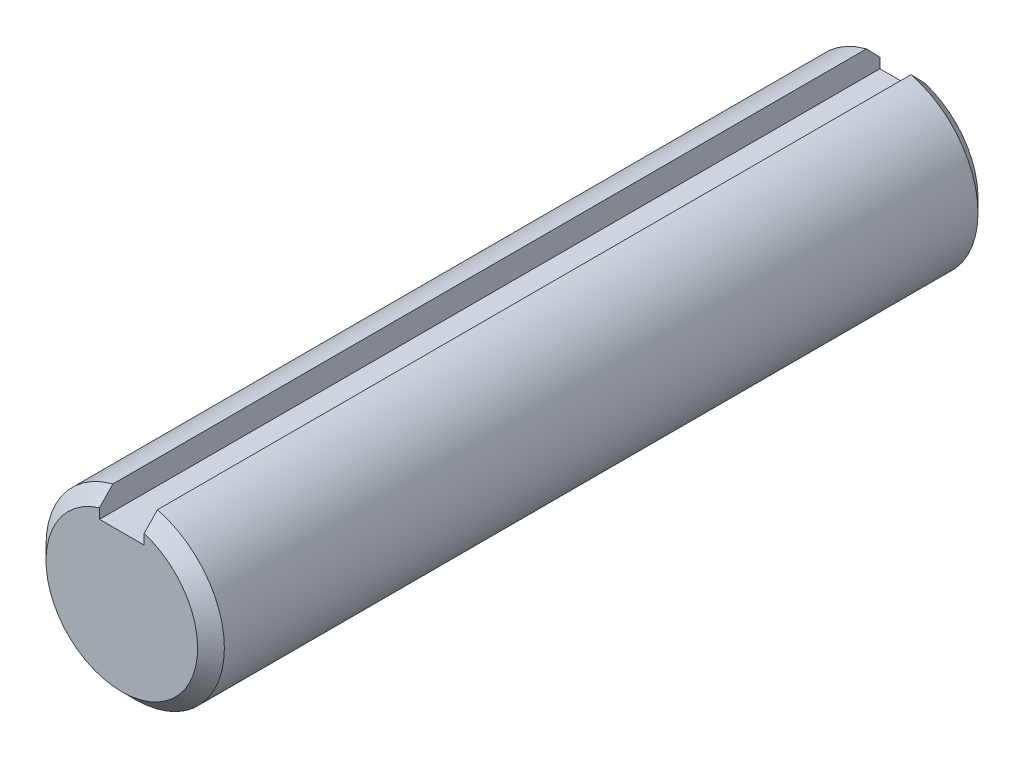
ISO-10303-21;
HEADER;
FILE_DESCRIPTION(('STEP AP214'),'2;1');
FILE_NAME('part.step','',(''),(''),'','','');
FILE_SCHEMA(('AUTOMOTIVE_DESIGN { 1 0 10303 214 1 1 1 1 }'));
ENDSEC;
DATA;
#1=APPLICATION_CONTEXT('core data for automotive mechanical design processes');
#2=APPLICATION_PROTOCOL_DEFINITION('international standard','automotive_design',2000,#1);
#3=PRODUCT_CONTEXT('',#1,'mechanical');
#4=PRODUCT('Part','Part','',(#3));
#5=PRODUCT_RELATED_PRODUCT_CATEGORY('part','',(#4));
#6=PRODUCT_DEFINITION_FORMATION('','',#4);
#7=PRODUCT_DEFINITION_CONTEXT('part definition',#1,'design');
#8=PRODUCT_DEFINITION('design','',#6,#7);
#9=PRODUCT_DEFINITION_SHAPE('','',#8);
#10=(LENGTH_UNIT() NAMED_UNIT(*) SI_UNIT(.MILLI.,.METRE.));
#11=(NAMED_UNIT(*) PLANE_ANGLE_UNIT() SI_UNIT($,.RADIAN.));
#12=(NAMED_UNIT(*) SI_UNIT($,.STERADIAN.) SOLID_ANGLE_UNIT());
#13=UNCERTAINTY_MEASURE_WITH_UNIT(LENGTH_MEASURE(1.E-05),#10,'distance_accuracy_value','');
#14=(GEOMETRIC_REPRESENTATION_CONTEXT(3) GLOBAL_UNCERTAINTY_ASSIGNED_CONTEXT((#13)) GLOBAL_UNIT_ASSIGNED_CONTEXT((#10,
#11,#12)) REPRESENTATION_CONTEXT('',''));
#15=CARTESIAN_POINT('',(0.,0.,0.));
#16=DIRECTION('',(0.,0.,1.));
#17=DIRECTION('',(1.,0.,0.));
#18=AXIS2_PLACEMENT_3D('',#15,#16,#17);
#19=CARTESIAN_POINT('',(0.,0.,17.5));
#20=DIRECTION('',(0.,0.,-1.));
#21=DIRECTION('',(-1.,0.,0.));
#22=AXIS2_PLACEMENT_3D('',#19,#20,#21);
#23=CYLINDRICAL_SURFACE('',#22,4.);
#24=CARTESIAN_POINT('',(0.,0.,16.9));
#25=DIRECTION('',(0.,0.,1.));
#26=DIRECTION('',(1.,0.,0.));
#27=AXIS2_PLACEMENT_3D('',#24,#25,#26);
#28=CIRCLE('',#27,4.);
#29=CARTESIAN_POINT('',(1.,3.87298334620742,16.9));
#30=VERTEX_POINT('',#29);
#31=CARTESIAN_POINT('',(-1.,3.87298334620742,16.9));
#32=VERTEX_POINT('',#31);
#33=EDGE_CURVE('E154',#30,#32,#28,.F.);
#34=ORIENTED_EDGE('',*,*,#33,.T.);
#35=DIRECTION('',(0.,0.,-1.));
#36=VECTOR('',#35,1.);
#37=CARTESIAN_POINT('',(-1.,3.87298334620742,17.5));
#38=LINE('',#37,#36);
#39=CARTESIAN_POINT('',(-1.,3.87298334620742,-16.9));
#40=VERTEX_POINT('',#39);
#41=EDGE_CURVE('E131',#32,#40,#38,.T.);
#42=ORIENTED_EDGE('',*,*,#41,.T.);
#43=CARTESIAN_POINT('',(0.,0.,-16.9));
#44=DIRECTION('',(0.,0.,1.));
#45=DIRECTION('',(1.,0.,0.));
#46=AXIS2_PLACEMENT_3D('',#43,#44,#45);
#47=CIRCLE('',#46,4.);
#48=CARTESIAN_POINT('',(1.,3.87298334620742,-16.9));
#49=VERTEX_POINT('',#48);
#50=EDGE_CURVE('E151',#40,#49,#47,.T.);
#51=ORIENTED_EDGE('',*,*,#50,.T.);
#52=DIRECTION('',(0.,0.,-1.));
#53=VECTOR('',#52,1.);
#54=CARTESIAN_POINT('',(1.,3.87298334620742,17.5));
#55=LINE('',#54,#53);
#56=EDGE_CURVE('E120',#49,#30,#55,.F.);
#57=ORIENTED_EDGE('',*,*,#56,.T.);
#58=EDGE_LOOP('',(#34,#42,#51,#57));
#59=FACE_BOUND('',#58,.T.);
#60=ADVANCED_FACE('F34',(#59),#23,.T.);
#61=CARTESIAN_POINT('',(0.,0.,17.5));
#62=DIRECTION('',(0.,0.,1.));
#63=DIRECTION('',(1.,0.,0.));
#64=AXIS2_PLACEMENT_3D('',#61,#62,#63);
#65=PLANE('',#64);
#66=DIRECTION('',(0.,-1.,0.));
#67=VECTOR('',#66,1.);
#68=CARTESIAN_POINT('',(-1.,4.,17.5));
#69=LINE('',#68,#67);
#70=CARTESIAN_POINT('',(-1.,3.24961536185438,17.5));
#71=VERTEX_POINT('',#70);
#72=CARTESIAN_POINT('',(-1.,2.8,17.5));
#73=VERTEX_POINT('',#72);
#74=EDGE_CURVE('E90',#71,#73,#69,.T.);
#75=ORIENTED_EDGE('',*,*,#74,.F.);
#76=CARTESIAN_POINT('',(0.,0.,17.5));
#77=DIRECTION('',(0.,0.,1.));
#78=DIRECTION('',(1.,0.,0.));
#79=AXIS2_PLACEMENT_3D('',#76,#77,#78);
#80=CIRCLE('',#79,3.4);
#81=CARTESIAN_POINT('',(1.,3.24961536185438,17.5));
#82=VERTEX_POINT('',#81);
#83=EDGE_CURVE('E146',#71,#82,#80,.T.);
#84=ORIENTED_EDGE('',*,*,#83,.T.);
#85=DIRECTION('',(0.,1.,0.));
#86=VECTOR('',#85,1.);
#87=CARTESIAN_POINT('',(1.,4.,17.5));
#88=LINE('',#87,#86);
#89=CARTESIAN_POINT('',(1.,2.8,17.5));
#90=VERTEX_POINT('',#89);
#91=EDGE_CURVE('E55',#90,#82,#88,.T.);
#92=ORIENTED_EDGE('',*,*,#91,.F.);
#93=DIRECTION('',(1.,0.,0.));
#94=VECTOR('',#93,1.);
#95=CARTESIAN_POINT('',(-1.,2.8,17.5));
#96=LINE('',#95,#94);
#97=EDGE_CURVE('E100',#73,#90,#96,.T.);
#98=ORIENTED_EDGE('',*,*,#97,.F.);
#99=EDGE_LOOP('',(#75,#84,#92,#98));
#100=FACE_BOUND('',#99,.T.);
#101=ADVANCED_FACE('F111',(#100),#65,.T.);
#102=CARTESIAN_POINT('',(0.,0.,-17.5));
#103=DIRECTION('',(0.,0.,1.));
#104=DIRECTION('',(1.,0.,0.));
#105=AXIS2_PLACEMENT_3D('',#102,#103,#104);
#106=PLANE('',#105);
#107=CARTESIAN_POINT('',(0.,0.,-17.5));
#108=DIRECTION('',(0.,0.,1.));
#109=DIRECTION('',(1.,0.,0.));
#110=AXIS2_PLACEMENT_3D('',#107,#108,#109);
#111=CIRCLE('',#110,3.39999999999999);
#112=CARTESIAN_POINT('',(1.,3.24961536185437,-17.5));
#113=VERTEX_POINT('',#112);
#114=CARTESIAN_POINT('',(-1.,3.24961536185437,-17.5));
#115=VERTEX_POINT('',#114);
#116=EDGE_CURVE('E148',#113,#115,#111,.F.);
#117=ORIENTED_EDGE('',*,*,#116,.T.);
#118=DIRECTION('',(0.,-1.,0.));
#119=VECTOR('',#118,1.);
#120=CARTESIAN_POINT('',(-1.,4.,-17.5));
#121=LINE('',#120,#119);
#122=CARTESIAN_POINT('',(-1.,2.8,-17.5));
#123=VERTEX_POINT('',#122);
#124=EDGE_CURVE('E113',#115,#123,#121,.T.);
#125=ORIENTED_EDGE('',*,*,#124,.T.);
#126=DIRECTION('',(1.,0.,0.));
#127=VECTOR('',#126,1.);
#128=CARTESIAN_POINT('',(-1.,2.8,-17.5));
#129=LINE('',#128,#127);
#130=CARTESIAN_POINT('',(1.,2.8,-17.5));
#131=VERTEX_POINT('',#130);
#132=EDGE_CURVE('E106',#123,#131,#129,.T.);
#133=ORIENTED_EDGE('',*,*,#132,.T.);
#134=DIRECTION('',(0.,1.,0.));
#135=VECTOR('',#134,1.);
#136=CARTESIAN_POINT('',(1.,4.,-17.5));
#137=LINE('',#136,#135);
#138=EDGE_CURVE('E109',#131,#113,#137,.T.);
#139=ORIENTED_EDGE('',*,*,#138,.T.);
#140=EDGE_LOOP('',(#117,#125,#133,#139));
#141=FACE_BOUND('',#140,.T.);
#142=ADVANCED_FACE('F166',(#141),#106,.F.);
#143=CARTESIAN_POINT('',(0.,0.,-16.9));
#144=DIRECTION('',(0.,0.,1.));
#145=DIRECTION('',(1.,0.,0.));
#146=AXIS2_PLACEMENT_3D('',#143,#144,#145);
#147=CONICAL_SURFACE('',#146,4.,0.785398163397448);
#148=CARTESIAN_POINT('',(-1.,1.35081586044512,-19.2193145776707));
#149=CARTESIAN_POINT('',(-1.,1.41488066306063,-19.1677819180893));
#150=CARTESIAN_POINT('',(-1.,1.47834718315388,-19.1155190121442));
#151=CARTESIAN_POINT('',(-1.,1.60431909726052,-19.0098610895691));
#152=CARTESIAN_POINT('',(-1.,1.66682460819919,-18.9564662125761));
#153=CARTESIAN_POINT('',(-1.,1.79110830645551,-18.8488748489054));
#154=CARTESIAN_POINT('',(-1.,1.85288669062793,-18.7946785885892));
#155=CARTESIAN_POINT('',(-1.,1.97588779267709,-18.6856554471097));
#156=CARTESIAN_POINT('',(-1.,2.03711049082799,-18.6308285437153));
#157=CARTESIAN_POINT('',(-1.,2.22007183752193,-18.4656732576281));
#158=CARTESIAN_POINT('',(-1.,2.34115805740112,-18.3546228023411));
#159=CARTESIAN_POINT('',(-1.,2.58220273418877,-18.1312938836685));
#160=CARTESIAN_POINT('',(-1.,2.70216111581648,-18.0190153393776));
#161=CARTESIAN_POINT('',(-1.,2.90589091931234,-17.8269857063987));
#162=CARTESIAN_POINT('',(-1.,2.98986154396475,-17.7474457040524));
#163=CARTESIAN_POINT('',(-1.,3.15749767385886,-17.5880337926722));
#164=CARTESIAN_POINT('',(-1.,3.24116315833901,-17.5081618618169));
#165=CARTESIAN_POINT('',(-1.,3.48509842555487,-17.2745671002813));
#166=CARTESIAN_POINT('',(-1.,3.64503682524598,-17.1204983050087));
#167=CARTESIAN_POINT('',(-1.,3.96429640051124,-16.811722329736));
#168=CARTESIAN_POINT('',(-1.,4.1236175738643,-16.6570151474428));
#169=CARTESIAN_POINT('',(-1.,4.44177985420495,-16.3471885210976));
#170=CARTESIAN_POINT('',(-1.,4.60062107239222,-16.1920691911779));
#171=CARTESIAN_POINT('',(-1.,4.91797030091099,-15.8814935510322));
#172=CARTESIAN_POINT('',(-1.,5.07647831497418,-15.7260372446202));
#173=CARTESIAN_POINT('',(-1.,5.23487471717617,-15.5704678156023));
#174=B_SPLINE_CURVE_WITH_KNOTS('',3,(#148,#149,#150,#151,#152,#153,#154,#155,#156,#157,#158,
#159,#160,#161,#162,#163,#164,#165,#166,#167,#168,#169,#170,#171,#172,#173),.UNSPECIFIED.,.F.,
.F.,(4,2,2,2,2,2,2,2,2,2,2,2,4),(0.,0.246638527108011,0.493246804550317,0.73978670666486,
0.98633532653122,1.47921612753496,1.97212959697097,2.31911430749398,2.66612220192963,
3.332345371537,3.99857093633251,4.6646280446703,5.33067765339345),.UNSPECIFIED.);
#175=EDGE_CURVE('E63',#115,#40,#174,.T.);
#176=ORIENTED_EDGE('',*,*,#175,.F.);
#177=ORIENTED_EDGE('',*,*,#116,.F.);
#178=CARTESIAN_POINT('',(1.,5.23487471717617,-15.5704678156023));
#179=CARTESIAN_POINT('',(1.,5.07642976511734,-15.7260850635911));
#180=CARTESIAN_POINT('',(1.,4.91787303822036,-15.8815890063281));
#181=CARTESIAN_POINT('',(1.,4.60043442524243,-16.1922515783813));
#182=CARTESIAN_POINT('',(1.,4.44155255272162,-16.3474102215566));
#183=CARTESIAN_POINT('',(1.,4.12339792056105,-16.6572286939957));
#184=CARTESIAN_POINT('',(1.,3.96412529582628,-16.8118886617124));
#185=CARTESIAN_POINT('',(1.,3.64495454195615,-17.1205770374935));
#186=CARTESIAN_POINT('',(1.,3.48505638500136,-17.2746054168307));
#187=CARTESIAN_POINT('',(1.,3.16427810361861,-17.5817896736052));
#188=CARTESIAN_POINT('',(1.,3.00339754942277,-17.7349451025749));
#189=CARTESIAN_POINT('',(1.,2.68026393133356,-18.0397741705045));
#190=CARTESIAN_POINT('',(1.,2.51801101305171,-18.1914479630795));
#191=CARTESIAN_POINT('',(1.,2.27284509960379,-18.4170936253633));
#192=CARTESIAN_POINT('',(1.,2.19080682391783,-18.4920145563211));
#193=CARTESIAN_POINT('',(1.,2.02594222380101,-18.6409764949062));
#194=CARTESIAN_POINT('',(1.,1.94311594332784,-18.7150175511038));
#195=CARTESIAN_POINT('',(1.,1.77634824406914,-18.8619013656389));
#196=CARTESIAN_POINT('',(1.,1.69240642828068,-18.9347436755316));
#197=CARTESIAN_POINT('',(1.,1.56532637426185,-19.0426501770363));
#198=CARTESIAN_POINT('',(1.,1.52276776255762,-19.0783961330172));
#199=CARTESIAN_POINT('',(1.,1.43717223649483,-19.1493154130559));
#200=CARTESIAN_POINT('',(1.,1.39413529386853,-19.1844887029652));
#201=CARTESIAN_POINT('',(1.,1.35081586044512,-19.2193145776707));
#202=B_SPLINE_CURVE_WITH_KNOTS('',3,(#178,#179,#180,#181,#182,#183,#184,#185,#186,#187,#188,
#189,#190,#191,#192,#193,#194,#195,#196,#197,#198,#199,#200,#201),.UNSPECIFIED.,.F.,.F.,(4,2,2,
2,2,2,2,2,2,2,2,4),(0.,0.66625401987663,1.33248079806412,1.9985031425817,2.66455545185874,
3.33092366291565,3.99722203595525,4.33052034592894,4.66380017110566,4.99720196323079,
5.16393407836719,5.3306760997552),.UNSPECIFIED.);
#203=EDGE_CURVE('E124',#49,#113,#202,.T.);
#204=ORIENTED_EDGE('',*,*,#203,.F.);
#205=ORIENTED_EDGE('',*,*,#50,.F.);
#206=EDGE_LOOP('',(#176,#177,#204,#205));
#207=FACE_BOUND('',#206,.T.);
#208=ADVANCED_FACE('F133',(#207),#147,.T.);
#209=CARTESIAN_POINT('',(0.,0.,17.5));
#210=DIRECTION('',(0.,0.,-1.));
#211=DIRECTION('',(-1.,0.,0.));
#212=AXIS2_PLACEMENT_3D('',#209,#210,#211);
#213=CONICAL_SURFACE('',#212,3.4,0.785398163397448);
#214=CARTESIAN_POINT('',(-1.,5.23487471717617,15.5704678156024));
#215=CARTESIAN_POINT('',(-1.,5.07642976511733,15.7260850635911));
#216=CARTESIAN_POINT('',(-1.,4.91787303822035,15.8815890063281));
#217=CARTESIAN_POINT('',(-1.,4.60043442524243,16.1922515783813));
#218=CARTESIAN_POINT('',(-1.,4.44155255272162,16.3474102215566));
#219=CARTESIAN_POINT('',(-1.,4.12339792056104,16.6572286939957));
#220=CARTESIAN_POINT('',(-1.,3.96412529582627,16.8118886617124));
#221=CARTESIAN_POINT('',(-1.,3.64495454195615,17.1205770374935));
#222=CARTESIAN_POINT('',(-1.,3.48505638500136,17.2746054168307));
#223=CARTESIAN_POINT('',(-1.,3.16427810361861,17.5817896736052));
#224=CARTESIAN_POINT('',(-1.,3.00339754942277,17.7349451025749));
#225=CARTESIAN_POINT('',(-1.,2.68026393133356,18.0397741705045));
#226=CARTESIAN_POINT('',(-1.,2.51801101305172,18.1914479630795));
#227=CARTESIAN_POINT('',(-1.,2.27284509960379,18.4170936253633));
#228=CARTESIAN_POINT('',(-1.,2.19080682391783,18.4920145563211));
#229=CARTESIAN_POINT('',(-1.,2.02594222380101,18.6409764949062));
#230=CARTESIAN_POINT('',(-1.,1.94311594332784,18.7150175511038));
#231=CARTESIAN_POINT('',(-1.,1.77634824406914,18.8619013656389));
#232=CARTESIAN_POINT('',(-1.,1.69240642828068,18.9347436755316));
#233=CARTESIAN_POINT('',(-1.,1.56532637426186,19.0426501770363));
#234=CARTESIAN_POINT('',(-1.,1.52276776255763,19.0783961330172));
#235=CARTESIAN_POINT('',(-1.,1.43717223649483,19.1493154130559));
#236=CARTESIAN_POINT('',(-1.,1.39413529386854,19.1844887029652));
#237=CARTESIAN_POINT('',(-1.,1.35081586044513,19.2193145776707));
#238=B_SPLINE_CURVE_WITH_KNOTS('',3,(#214,#215,#216,#217,#218,#219,#220,#221,#222,#223,#224,
#225,#226,#227,#228,#229,#230,#231,#232,#233,#234,#235,#236,#237),.UNSPECIFIED.,.F.,.F.,(4,2,2,
2,2,2,2,2,2,2,2,4),(0.,0.666254019876632,1.33248079806412,1.9985031425817,2.66455545185874,
3.33092366291565,3.99722203595525,4.33052034592893,4.66380017110566,4.99720196323078,
5.16393407836718,5.33067609975519),.UNSPECIFIED.);
#239=EDGE_CURVE('E11',#32,#71,#238,.T.);
#240=ORIENTED_EDGE('',*,*,#239,.F.);
#241=ORIENTED_EDGE('',*,*,#33,.F.);
#242=CARTESIAN_POINT('',(1.,1.35081586044513,19.2193145776707));
#243=CARTESIAN_POINT('',(1.,1.41488066306063,19.1677819180893));
#244=CARTESIAN_POINT('',(1.,1.47834718315389,19.1155190121442));
#245=CARTESIAN_POINT('',(1.,1.60431909726053,19.0098610895691));
#246=CARTESIAN_POINT('',(1.,1.66682460819919,18.9564662125761));
#247=CARTESIAN_POINT('',(1.,1.79110830645551,18.8488748489054));
#248=CARTESIAN_POINT('',(1.,1.85288669062794,18.7946785885892));
#249=CARTESIAN_POINT('',(1.,1.97588779267709,18.6856554471097));
#250=CARTESIAN_POINT('',(1.,2.03711049082799,18.6308285437153));
#251=CARTESIAN_POINT('',(1.,2.22007183752194,18.4656732576281));
#252=CARTESIAN_POINT('',(1.,2.34115805740112,18.3546228023411));
#253=CARTESIAN_POINT('',(1.,2.58220273418877,18.1312938836685));
#254=CARTESIAN_POINT('',(1.,2.70216111581649,18.0190153393776));
#255=CARTESIAN_POINT('',(1.,2.90589091931234,17.8269857063987));
#256=CARTESIAN_POINT('',(1.,2.98986154396476,17.7474457040524));
#257=CARTESIAN_POINT('',(1.,3.15749767385886,17.5880337926722));
#258=CARTESIAN_POINT('',(1.,3.24116315833901,17.5081618618169));
#259=CARTESIAN_POINT('',(1.,3.48509842555487,17.2745671002813));
#260=CARTESIAN_POINT('',(1.,3.64503682524598,17.1204983050087));
#261=CARTESIAN_POINT('',(1.,3.96429640051124,16.811722329736));
#262=CARTESIAN_POINT('',(1.,4.1236175738643,16.6570151474428));
#263=CARTESIAN_POINT('',(1.,4.44177985420495,16.3471885210976));
#264=CARTESIAN_POINT('',(1.,4.60062107239221,16.1920691911779));
#265=CARTESIAN_POINT('',(1.,4.91797030091098,15.8814935510322));
#266=CARTESIAN_POINT('',(1.,5.07647831497417,15.7260372446202));
#267=CARTESIAN_POINT('',(1.,5.23487471717617,15.5704678156024));
#268=B_SPLINE_CURVE_WITH_KNOTS('',3,(#242,#243,#244,#245,#246,#247,#248,#249,#250,#251,#252,
#253,#254,#255,#256,#257,#258,#259,#260,#261,#262,#263,#264,#265,#266,#267),.UNSPECIFIED.,.F.,
.F.,(4,2,2,2,2,2,2,2,2,2,2,2,4),(0.,0.246638527108011,0.493246804550317,0.739786706664863,
0.986335326531219,1.47921612753496,1.97212959697097,2.31911430749398,2.66612220192962,
3.33234537153699,3.9985709363325,4.66462804467029,5.33067765339344),.UNSPECIFIED.);
#269=EDGE_CURVE('E48',#82,#30,#268,.T.);
#270=ORIENTED_EDGE('',*,*,#269,.F.);
#271=ORIENTED_EDGE('',*,*,#83,.F.);
#272=EDGE_LOOP('',(#240,#241,#270,#271));
#273=FACE_BOUND('',#272,.T.);
#274=ADVANCED_FACE('F36',(#273),#213,.T.);
#275=CARTESIAN_POINT('',(-1.,4.,-17.5));
#276=DIRECTION('',(-1.,0.,0.));
#277=DIRECTION('',(0.,-1.,0.));
#278=AXIS2_PLACEMENT_3D('',#275,#276,#277);
#279=PLANE('',#278);
#280=ORIENTED_EDGE('',*,*,#175,.T.);
#281=ORIENTED_EDGE('',*,*,#41,.F.);
#282=ORIENTED_EDGE('',*,*,#239,.T.);
#283=ORIENTED_EDGE('',*,*,#74,.T.);
#284=DIRECTION('',(0.,0.,1.));
#285=VECTOR('',#284,1.);
#286=CARTESIAN_POINT('',(-1.,2.8,-17.5));
#287=LINE('',#286,#285);
#288=EDGE_CURVE('E93',#123,#73,#287,.T.);
#289=ORIENTED_EDGE('',*,*,#288,.F.);
#290=ORIENTED_EDGE('',*,*,#124,.F.);
#291=EDGE_LOOP('',(#280,#281,#282,#283,#289,#290));
#292=FACE_BOUND('',#291,.T.);
#293=ADVANCED_FACE('F92',(#292),#279,.F.);
#294=CARTESIAN_POINT('',(1.,4.,-17.5));
#295=DIRECTION('',(1.,0.,0.));
#296=DIRECTION('',(0.,1.,0.));
#297=AXIS2_PLACEMENT_3D('',#294,#295,#296);
#298=PLANE('',#297);
#299=ORIENTED_EDGE('',*,*,#203,.T.);
#300=ORIENTED_EDGE('',*,*,#138,.F.);
#301=DIRECTION('',(0.,0.,1.));
#302=VECTOR('',#301,1.);
#303=CARTESIAN_POINT('',(1.,2.8,-17.5));
#304=LINE('',#303,#302);
#305=EDGE_CURVE('E108',#131,#90,#304,.T.);
#306=ORIENTED_EDGE('',*,*,#305,.T.);
#307=ORIENTED_EDGE('',*,*,#91,.T.);
#308=ORIENTED_EDGE('',*,*,#269,.T.);
#309=ORIENTED_EDGE('',*,*,#56,.F.);
#310=EDGE_LOOP('',(#299,#300,#306,#307,#308,#309));
#311=FACE_BOUND('',#310,.T.);
#312=ADVANCED_FACE('F136',(#311),#298,.F.);
#313=CARTESIAN_POINT('',(-1.,2.8,-17.5));
#314=DIRECTION('',(0.,-1.,0.));
#315=DIRECTION('',(0.,0.,-1.));
#316=AXIS2_PLACEMENT_3D('',#313,#314,#315);
#317=PLANE('',#316);
#318=ORIENTED_EDGE('',*,*,#305,.F.);
#319=ORIENTED_EDGE('',*,*,#132,.F.);
#320=ORIENTED_EDGE('',*,*,#288,.T.);
#321=ORIENTED_EDGE('',*,*,#97,.T.);
#322=EDGE_LOOP('',(#318,#319,#320,#321));
#323=FACE_BOUND('',#322,.T.);
#324=ADVANCED_FACE('F104',(#323),#317,.F.);
#325=CLOSED_SHELL('',(#60,#101,#142,#208,#274,#293,#312,#324));
#326=MANIFOLD_SOLID_BREP('B2',#325);
#327=ADVANCED_BREP_SHAPE_REPRESENTATION('',(#18,#326),#14);
#328=SHAPE_DEFINITION_REPRESENTATION(#9,#327);
ENDSEC;
END-ISO-10303-21;
